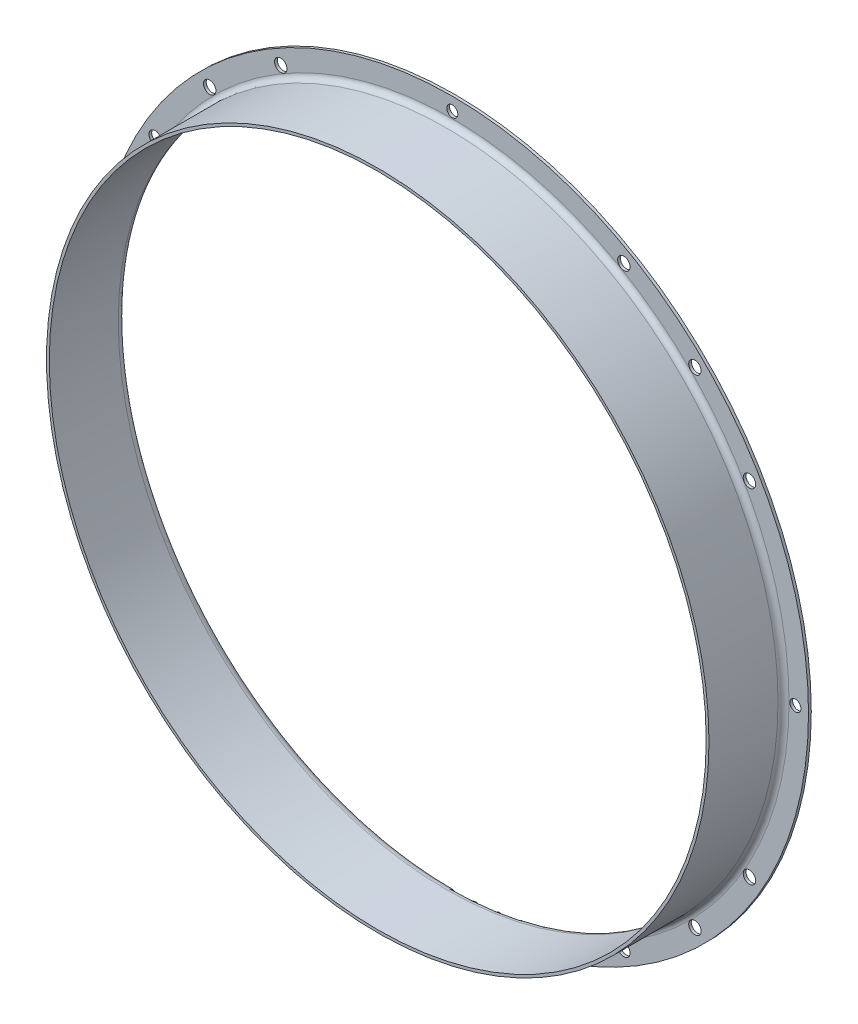
ISO-10303-21;
HEADER;
FILE_DESCRIPTION(('STEP AP214'),'2;1');
FILE_NAME('part.step','',(''),(''),'','','');
FILE_SCHEMA(('AUTOMOTIVE_DESIGN { 1 0 10303 214 1 1 1 1 }'));
ENDSEC;
DATA;
#1=APPLICATION_CONTEXT('core data for automotive mechanical design processes');
#2=APPLICATION_PROTOCOL_DEFINITION('international standard','automotive_design',2000,#1);
#3=PRODUCT_CONTEXT('',#1,'mechanical');
#4=PRODUCT('Part','Part','',(#3));
#5=PRODUCT_RELATED_PRODUCT_CATEGORY('part','',(#4));
#6=PRODUCT_DEFINITION_FORMATION('','',#4);
#7=PRODUCT_DEFINITION_CONTEXT('part definition',#1,'design');
#8=PRODUCT_DEFINITION('design','',#6,#7);
#9=PRODUCT_DEFINITION_SHAPE('','',#8);
#10=(LENGTH_UNIT() NAMED_UNIT(*) SI_UNIT(.MILLI.,.METRE.));
#11=(NAMED_UNIT(*) PLANE_ANGLE_UNIT() SI_UNIT($,.RADIAN.));
#12=(NAMED_UNIT(*) SI_UNIT($,.STERADIAN.) SOLID_ANGLE_UNIT());
#13=UNCERTAINTY_MEASURE_WITH_UNIT(LENGTH_MEASURE(1.E-05),#10,'distance_accuracy_value','');
#14=(GEOMETRIC_REPRESENTATION_CONTEXT(3) GLOBAL_UNCERTAINTY_ASSIGNED_CONTEXT((#13)) GLOBAL_UNIT_ASSIGNED_CONTEXT((#10,
#11,#12)) REPRESENTATION_CONTEXT('',''));
#15=CARTESIAN_POINT('',(0.,0.,0.));
#16=DIRECTION('',(0.,0.,1.));
#17=DIRECTION('',(1.,0.,0.));
#18=AXIS2_PLACEMENT_3D('',#15,#16,#17);
#19=CARTESIAN_POINT('',(0.,121.95,0.999999999999999));
#20=DIRECTION('',(0.,0.,-1.));
#21=DIRECTION('',(-1.,0.,0.));
#22=AXIS2_PLACEMENT_3D('',#19,#20,#21);
#23=PLANE('',#22);
#24=CARTESIAN_POINT('',(-87.8580175624281,-87.858017562429,0.999999999999999));
#25=DIRECTION('',(0.,0.,1.));
#26=DIRECTION('',(1.,0.,0.));
#27=AXIS2_PLACEMENT_3D('',#24,#25,#26);
#28=CIRCLE('',#27,2.25);
#29=CARTESIAN_POINT('',(-85.6080175624281,-87.858017562429,0.999999999999999));
#30=VERTEX_POINT('',#29);
#31=EDGE_CURVE('E50',#30,#30,#28,.T.);
#32=ORIENTED_EDGE('',*,*,#31,.F.);
#33=EDGE_LOOP('',(#32));
#34=FACE_BOUND('',#33,.T.);
#35=CARTESIAN_POINT('',(-87.8580175624293,87.8580175624277,0.999999999999999));
#36=DIRECTION('',(0.,0.,1.));
#37=DIRECTION('',(1.,0.,0.));
#38=AXIS2_PLACEMENT_3D('',#35,#36,#37);
#39=CIRCLE('',#38,2.25);
#40=CARTESIAN_POINT('',(-85.6080175624293,87.8580175624277,0.999999999999999));
#41=VERTEX_POINT('',#40);
#42=EDGE_CURVE('E49',#41,#41,#39,.T.);
#43=ORIENTED_EDGE('',*,*,#42,.F.);
#44=EDGE_LOOP('',(#43));
#45=FACE_BOUND('',#44,.T.);
#46=CARTESIAN_POINT('',(87.8580175624281,87.858017562429,0.999999999999999));
#47=DIRECTION('',(0.,0.,1.));
#48=DIRECTION('',(1.,0.,0.));
#49=AXIS2_PLACEMENT_3D('',#46,#47,#48);
#50=CIRCLE('',#49,2.25);
#51=CARTESIAN_POINT('',(90.1080175624281,87.858017562429,0.999999999999999));
#52=VERTEX_POINT('',#51);
#53=EDGE_CURVE('E66',#52,#52,#50,.T.);
#54=ORIENTED_EDGE('',*,*,#53,.F.);
#55=EDGE_LOOP('',(#54));
#56=FACE_BOUND('',#55,.T.);
#57=CARTESIAN_POINT('',(-124.25,0.,0.999999999999999));
#58=DIRECTION('',(0.,0.,1.));
#59=DIRECTION('',(1.,0.,0.));
#60=AXIS2_PLACEMENT_3D('',#57,#58,#59);
#61=CIRCLE('',#60,2.);
#62=CARTESIAN_POINT('',(-122.25,0.,0.999999999999999));
#63=VERTEX_POINT('',#62);
#64=EDGE_CURVE('E78',#63,#63,#61,.T.);
#65=ORIENTED_EDGE('',*,*,#64,.F.);
#66=EDGE_LOOP('',(#65));
#67=FACE_BOUND('',#66,.T.);
#68=CARTESIAN_POINT('',(-4.33816556351259E-13,124.25,0.999999999999999));
#69=DIRECTION('',(0.,0.,1.));
#70=DIRECTION('',(1.,0.,0.));
#71=AXIS2_PLACEMENT_3D('',#68,#69,#70);
#72=CIRCLE('',#71,2.);
#73=CARTESIAN_POINT('',(1.99999999999957,124.25,0.999999999999999));
#74=VERTEX_POINT('',#73);
#75=EDGE_CURVE('E84',#74,#74,#72,.T.);
#76=ORIENTED_EDGE('',*,*,#75,.F.);
#77=EDGE_LOOP('',(#76));
#78=FACE_BOUND('',#77,.T.);
#79=CARTESIAN_POINT('',(124.25,0.,0.999999999999999));
#80=DIRECTION('',(0.,0.,1.));
#81=DIRECTION('',(1.,0.,0.));
#82=AXIS2_PLACEMENT_3D('',#79,#80,#81);
#83=CIRCLE('',#82,2.);
#84=CARTESIAN_POINT('',(126.25,0.,0.999999999999999));
#85=VERTEX_POINT('',#84);
#86=EDGE_CURVE('E90',#85,#85,#83,.T.);
#87=ORIENTED_EDGE('',*,*,#86,.F.);
#88=EDGE_LOOP('',(#87));
#89=FACE_BOUND('',#88,.T.);
#90=CARTESIAN_POINT('',(107.603656420216,62.1250000000013,1.));
#91=DIRECTION('',(0.,0.,1.));
#92=DIRECTION('',(1.,0.,0.));
#93=AXIS2_PLACEMENT_3D('',#90,#91,#92);
#94=CIRCLE('',#93,2.24999999999999);
#95=CARTESIAN_POINT('',(109.853656420216,62.1250000000013,1.));
#96=VERTEX_POINT('',#95);
#97=EDGE_CURVE('E96',#96,#96,#94,.T.);
#98=ORIENTED_EDGE('',*,*,#97,.F.);
#99=EDGE_LOOP('',(#98));
#100=FACE_BOUND('',#99,.T.);
#101=CARTESIAN_POINT('',(107.603656420217,-62.124999999999,1.));
#102=DIRECTION('',(0.,0.,1.));
#103=DIRECTION('',(1.,0.,0.));
#104=AXIS2_PLACEMENT_3D('',#101,#102,#103);
#105=CIRCLE('',#104,2.24999999999999);
#106=CARTESIAN_POINT('',(109.853656420217,-62.124999999999,1.));
#107=VERTEX_POINT('',#106);
#108=EDGE_CURVE('E102',#107,#107,#105,.T.);
#109=ORIENTED_EDGE('',*,*,#108,.F.);
#110=EDGE_LOOP('',(#109));
#111=FACE_BOUND('',#110,.T.);
#112=CARTESIAN_POINT('',(62.1250000000009,-107.603656420216,1.));
#113=DIRECTION('',(0.,0.,1.));
#114=DIRECTION('',(1.,0.,0.));
#115=AXIS2_PLACEMENT_3D('',#112,#113,#114);
#116=CIRCLE('',#115,2.24999999999999);
#117=CARTESIAN_POINT('',(64.3750000000009,-107.603656420216,1.));
#118=VERTEX_POINT('',#117);
#119=EDGE_CURVE('E108',#118,#118,#116,.T.);
#120=ORIENTED_EDGE('',*,*,#119,.F.);
#121=EDGE_LOOP('',(#120));
#122=FACE_BOUND('',#121,.T.);
#123=CARTESIAN_POINT('',(-62.1250000000001,-107.603656420216,1.));
#124=DIRECTION('',(0.,0.,1.));
#125=DIRECTION('',(1.,0.,0.));
#126=AXIS2_PLACEMENT_3D('',#123,#124,#125);
#127=CIRCLE('',#126,2.24999999999999);
#128=CARTESIAN_POINT('',(-59.8750000000001,-107.603656420216,1.));
#129=VERTEX_POINT('',#128);
#130=EDGE_CURVE('E114',#129,#129,#127,.T.);
#131=ORIENTED_EDGE('',*,*,#130,.F.);
#132=EDGE_LOOP('',(#131));
#133=FACE_BOUND('',#132,.T.);
#134=CARTESIAN_POINT('',(-107.603656420216,-62.1250000000005,1.));
#135=DIRECTION('',(0.,0.,1.));
#136=DIRECTION('',(1.,0.,0.));
#137=AXIS2_PLACEMENT_3D('',#134,#135,#136);
#138=CIRCLE('',#137,2.24999999999999);
#139=CARTESIAN_POINT('',(-105.353656420216,-62.1250000000005,1.));
#140=VERTEX_POINT('',#139);
#141=EDGE_CURVE('E120',#140,#140,#138,.T.);
#142=ORIENTED_EDGE('',*,*,#141,.F.);
#143=EDGE_LOOP('',(#142));
#144=FACE_BOUND('',#143,.T.);
#145=CARTESIAN_POINT('',(-107.603656420217,62.1249999999997,1.));
#146=DIRECTION('',(0.,0.,1.));
#147=DIRECTION('',(1.,0.,0.));
#148=AXIS2_PLACEMENT_3D('',#145,#146,#147);
#149=CIRCLE('',#148,2.24999999999999);
#150=CARTESIAN_POINT('',(-105.353656420217,62.1249999999997,1.));
#151=VERTEX_POINT('',#150);
#152=EDGE_CURVE('E126',#151,#151,#149,.T.);
#153=ORIENTED_EDGE('',*,*,#152,.F.);
#154=EDGE_LOOP('',(#153));
#155=FACE_BOUND('',#154,.T.);
#156=CARTESIAN_POINT('',(-62.1250000000001,107.603656420216,1.));
#157=DIRECTION('',(0.,0.,1.));
#158=DIRECTION('',(1.,0.,0.));
#159=AXIS2_PLACEMENT_3D('',#156,#157,#158);
#160=CIRCLE('',#159,2.24999999999999);
#161=CARTESIAN_POINT('',(-59.8750000000002,107.603656420216,1.));
#162=VERTEX_POINT('',#161);
#163=EDGE_CURVE('E132',#162,#162,#160,.T.);
#164=ORIENTED_EDGE('',*,*,#163,.F.);
#165=EDGE_LOOP('',(#164));
#166=FACE_BOUND('',#165,.T.);
#167=CARTESIAN_POINT('',(62.1250000000001,107.603656420216,1.));
#168=DIRECTION('',(0.,0.,1.));
#169=DIRECTION('',(1.,0.,0.));
#170=AXIS2_PLACEMENT_3D('',#167,#168,#169);
#171=CIRCLE('',#170,2.24999999999999);
#172=CARTESIAN_POINT('',(64.3750000000001,107.603656420216,1.));
#173=VERTEX_POINT('',#172);
#174=EDGE_CURVE('E138',#173,#173,#171,.T.);
#175=ORIENTED_EDGE('',*,*,#174,.F.);
#176=EDGE_LOOP('',(#175));
#177=FACE_BOUND('',#176,.T.);
#178=CARTESIAN_POINT('',(0.,0.,1.));
#179=DIRECTION('',(0.,0.,1.));
#180=DIRECTION('',(1.,0.,0.));
#181=AXIS2_PLACEMENT_3D('',#178,#179,#180);
#182=CIRCLE('',#181,121.95);
#183=CARTESIAN_POINT('',(121.95,0.,1.));
#184=VERTEX_POINT('',#183);
#185=EDGE_CURVE('E147',#184,#184,#182,.T.);
#186=ORIENTED_EDGE('',*,*,#185,.F.);
#187=EDGE_LOOP('',(#186));
#188=FACE_BOUND('',#187,.T.);
#189=CARTESIAN_POINT('',(0.,0.,1.));
#190=DIRECTION('',(0.,0.,1.));
#191=DIRECTION('',(1.,0.,0.));
#192=AXIS2_PLACEMENT_3D('',#189,#190,#191);
#193=CIRCLE('',#192,129.);
#194=CARTESIAN_POINT('',(129.,0.,1.));
#195=VERTEX_POINT('',#194);
#196=EDGE_CURVE('E144',#195,#195,#193,.T.);
#197=ORIENTED_EDGE('',*,*,#196,.T.);
#198=EDGE_LOOP('',(#197));
#199=FACE_BOUND('',#198,.T.);
#200=CARTESIAN_POINT('',(1.30144966905378E-12,-124.25,0.999999999999999));
#201=DIRECTION('',(0.,0.,1.));
#202=DIRECTION('',(1.,0.,0.));
#203=AXIS2_PLACEMENT_3D('',#200,#201,#202);
#204=CIRCLE('',#203,2.);
#205=CARTESIAN_POINT('',(2.0000000000013,-124.25,0.999999999999999));
#206=VERTEX_POINT('',#205);
#207=EDGE_CURVE('E72',#206,#206,#204,.T.);
#208=ORIENTED_EDGE('',*,*,#207,.F.);
#209=EDGE_LOOP('',(#208));
#210=FACE_BOUND('',#209,.T.);
#211=CARTESIAN_POINT('',(87.8580175624299,-87.8580175624271,0.999999999999999));
#212=DIRECTION('',(0.,0.,1.));
#213=DIRECTION('',(1.,0.,0.));
#214=AXIS2_PLACEMENT_3D('',#211,#212,#213);
#215=CIRCLE('',#214,2.25);
#216=CARTESIAN_POINT('',(90.1080175624299,-87.8580175624271,0.999999999999999));
#217=VERTEX_POINT('',#216);
#218=EDGE_CURVE('E61',#217,#217,#215,.T.);
#219=ORIENTED_EDGE('',*,*,#218,.F.);
#220=EDGE_LOOP('',(#219));
#221=FACE_BOUND('',#220,.T.);
#222=ADVANCED_FACE('F31',(#34,#45,#56,#67,#78,#89,#100,#111,#122,#133,#144,#155,#166,#177,#188,
#199,#210,#221),#23,.F.);
#223=CARTESIAN_POINT('',(0.,0.,36.2891250479502));
#224=DIRECTION('',(0.,0.,1.));
#225=DIRECTION('',(1.,0.,0.));
#226=AXIS2_PLACEMENT_3D('',#223,#224,#225);
#227=CYLINDRICAL_SURFACE('',#226,129.);
#228=ORIENTED_EDGE('',*,*,#196,.F.);
#229=EDGE_LOOP('',(#228));
#230=FACE_BOUND('',#229,.T.);
#231=CARTESIAN_POINT('',(0.,0.,0.));
#232=DIRECTION('',(0.,0.,1.));
#233=DIRECTION('',(1.,0.,0.));
#234=AXIS2_PLACEMENT_3D('',#231,#232,#233);
#235=CIRCLE('',#234,129.);
#236=CARTESIAN_POINT('',(129.,0.,0.));
#237=VERTEX_POINT('',#236);
#238=EDGE_CURVE('E10',#237,#237,#235,.T.);
#239=ORIENTED_EDGE('',*,*,#238,.T.);
#240=EDGE_LOOP('',(#239));
#241=FACE_BOUND('',#240,.T.);
#242=ADVANCED_FACE('F33',(#230,#241),#227,.T.);
#243=CARTESIAN_POINT('',(0.,129.,0.));
#244=DIRECTION('',(0.,0.,1.));
#245=DIRECTION('',(1.,0.,0.));
#246=AXIS2_PLACEMENT_3D('',#243,#244,#245);
#247=PLANE('',#246);
#248=CARTESIAN_POINT('',(87.8580175624299,-87.8580175624271,0.));
#249=DIRECTION('',(0.,0.,1.));
#250=DIRECTION('',(1.,0.,0.));
#251=AXIS2_PLACEMENT_3D('',#248,#249,#250);
#252=CIRCLE('',#251,2.25);
#253=CARTESIAN_POINT('',(90.1080175624299,-87.8580175624271,0.));
#254=VERTEX_POINT('',#253);
#255=EDGE_CURVE('E35',#254,#254,#252,.T.);
#256=ORIENTED_EDGE('',*,*,#255,.T.);
#257=EDGE_LOOP('',(#256));
#258=FACE_BOUND('',#257,.T.);
#259=CARTESIAN_POINT('',(-87.8580175624281,-87.858017562429,0.));
#260=DIRECTION('',(0.,0.,1.));
#261=DIRECTION('',(1.,0.,0.));
#262=AXIS2_PLACEMENT_3D('',#259,#260,#261);
#263=CIRCLE('',#262,2.25);
#264=CARTESIAN_POINT('',(-85.6080175624281,-87.858017562429,0.));
#265=VERTEX_POINT('',#264);
#266=EDGE_CURVE('E47',#265,#265,#263,.T.);
#267=ORIENTED_EDGE('',*,*,#266,.T.);
#268=EDGE_LOOP('',(#267));
#269=FACE_BOUND('',#268,.T.);
#270=CARTESIAN_POINT('',(-87.8580175624293,87.8580175624277,0.));
#271=DIRECTION('',(0.,0.,1.));
#272=DIRECTION('',(1.,0.,0.));
#273=AXIS2_PLACEMENT_3D('',#270,#271,#272);
#274=CIRCLE('',#273,2.25);
#275=CARTESIAN_POINT('',(-85.6080175624293,87.8580175624277,0.));
#276=VERTEX_POINT('',#275);
#277=EDGE_CURVE('E54',#276,#276,#274,.T.);
#278=ORIENTED_EDGE('',*,*,#277,.T.);
#279=EDGE_LOOP('',(#278));
#280=FACE_BOUND('',#279,.T.);
#281=CARTESIAN_POINT('',(87.8580175624281,87.858017562429,0.));
#282=DIRECTION('',(0.,0.,1.));
#283=DIRECTION('',(1.,0.,0.));
#284=AXIS2_PLACEMENT_3D('',#281,#282,#283);
#285=CIRCLE('',#284,2.25);
#286=CARTESIAN_POINT('',(90.1080175624281,87.858017562429,0.));
#287=VERTEX_POINT('',#286);
#288=EDGE_CURVE('E69',#287,#287,#285,.T.);
#289=ORIENTED_EDGE('',*,*,#288,.T.);
#290=EDGE_LOOP('',(#289));
#291=FACE_BOUND('',#290,.T.);
#292=CARTESIAN_POINT('',(1.30144966905378E-12,-124.25,0.));
#293=DIRECTION('',(0.,0.,1.));
#294=DIRECTION('',(1.,0.,0.));
#295=AXIS2_PLACEMENT_3D('',#292,#293,#294);
#296=CIRCLE('',#295,2.);
#297=CARTESIAN_POINT('',(2.0000000000013,-124.25,0.));
#298=VERTEX_POINT('',#297);
#299=EDGE_CURVE('E75',#298,#298,#296,.T.);
#300=ORIENTED_EDGE('',*,*,#299,.T.);
#301=EDGE_LOOP('',(#300));
#302=FACE_BOUND('',#301,.T.);
#303=CARTESIAN_POINT('',(-124.25,0.,0.));
#304=DIRECTION('',(0.,0.,1.));
#305=DIRECTION('',(1.,0.,0.));
#306=AXIS2_PLACEMENT_3D('',#303,#304,#305);
#307=CIRCLE('',#306,2.);
#308=CARTESIAN_POINT('',(-122.25,0.,0.));
#309=VERTEX_POINT('',#308);
#310=EDGE_CURVE('E81',#309,#309,#307,.T.);
#311=ORIENTED_EDGE('',*,*,#310,.T.);
#312=EDGE_LOOP('',(#311));
#313=FACE_BOUND('',#312,.T.);
#314=CARTESIAN_POINT('',(-4.33816556351259E-13,124.25,0.));
#315=DIRECTION('',(0.,0.,1.));
#316=DIRECTION('',(1.,0.,0.));
#317=AXIS2_PLACEMENT_3D('',#314,#315,#316);
#318=CIRCLE('',#317,2.);
#319=CARTESIAN_POINT('',(1.99999999999957,124.25,0.));
#320=VERTEX_POINT('',#319);
#321=EDGE_CURVE('E87',#320,#320,#318,.T.);
#322=ORIENTED_EDGE('',*,*,#321,.T.);
#323=EDGE_LOOP('',(#322));
#324=FACE_BOUND('',#323,.T.);
#325=CARTESIAN_POINT('',(124.25,0.,0.));
#326=DIRECTION('',(0.,0.,1.));
#327=DIRECTION('',(1.,0.,0.));
#328=AXIS2_PLACEMENT_3D('',#325,#326,#327);
#329=CIRCLE('',#328,2.);
#330=CARTESIAN_POINT('',(126.25,0.,0.));
#331=VERTEX_POINT('',#330);
#332=EDGE_CURVE('E93',#331,#331,#329,.T.);
#333=ORIENTED_EDGE('',*,*,#332,.T.);
#334=EDGE_LOOP('',(#333));
#335=FACE_BOUND('',#334,.T.);
#336=CARTESIAN_POINT('',(107.603656420216,62.1250000000013,0.));
#337=DIRECTION('',(0.,0.,1.));
#338=DIRECTION('',(1.,0.,0.));
#339=AXIS2_PLACEMENT_3D('',#336,#337,#338);
#340=CIRCLE('',#339,2.25);
#341=CARTESIAN_POINT('',(109.853656420216,62.1250000000013,0.));
#342=VERTEX_POINT('',#341);
#343=EDGE_CURVE('E99',#342,#342,#340,.T.);
#344=ORIENTED_EDGE('',*,*,#343,.T.);
#345=EDGE_LOOP('',(#344));
#346=FACE_BOUND('',#345,.T.);
#347=CARTESIAN_POINT('',(107.603656420217,-62.124999999999,0.));
#348=DIRECTION('',(0.,0.,1.));
#349=DIRECTION('',(1.,0.,0.));
#350=AXIS2_PLACEMENT_3D('',#347,#348,#349);
#351=CIRCLE('',#350,2.25);
#352=CARTESIAN_POINT('',(109.853656420217,-62.124999999999,0.));
#353=VERTEX_POINT('',#352);
#354=EDGE_CURVE('E105',#353,#353,#351,.T.);
#355=ORIENTED_EDGE('',*,*,#354,.T.);
#356=EDGE_LOOP('',(#355));
#357=FACE_BOUND('',#356,.T.);
#358=CARTESIAN_POINT('',(62.1250000000009,-107.603656420216,0.));
#359=DIRECTION('',(0.,0.,1.));
#360=DIRECTION('',(1.,0.,0.));
#361=AXIS2_PLACEMENT_3D('',#358,#359,#360);
#362=CIRCLE('',#361,2.25);
#363=CARTESIAN_POINT('',(64.3750000000009,-107.603656420216,0.));
#364=VERTEX_POINT('',#363);
#365=EDGE_CURVE('E111',#364,#364,#362,.T.);
#366=ORIENTED_EDGE('',*,*,#365,.T.);
#367=EDGE_LOOP('',(#366));
#368=FACE_BOUND('',#367,.T.);
#369=CARTESIAN_POINT('',(-62.1250000000001,-107.603656420216,0.));
#370=DIRECTION('',(0.,0.,1.));
#371=DIRECTION('',(1.,0.,0.));
#372=AXIS2_PLACEMENT_3D('',#369,#370,#371);
#373=CIRCLE('',#372,2.25);
#374=CARTESIAN_POINT('',(-59.8750000000001,-107.603656420216,0.));
#375=VERTEX_POINT('',#374);
#376=EDGE_CURVE('E117',#375,#375,#373,.T.);
#377=ORIENTED_EDGE('',*,*,#376,.T.);
#378=EDGE_LOOP('',(#377));
#379=FACE_BOUND('',#378,.T.);
#380=CARTESIAN_POINT('',(-107.603656420216,-62.1250000000005,0.));
#381=DIRECTION('',(0.,0.,1.));
#382=DIRECTION('',(1.,0.,0.));
#383=AXIS2_PLACEMENT_3D('',#380,#381,#382);
#384=CIRCLE('',#383,2.25);
#385=CARTESIAN_POINT('',(-105.353656420216,-62.1250000000005,0.));
#386=VERTEX_POINT('',#385);
#387=EDGE_CURVE('E123',#386,#386,#384,.T.);
#388=ORIENTED_EDGE('',*,*,#387,.T.);
#389=EDGE_LOOP('',(#388));
#390=FACE_BOUND('',#389,.T.);
#391=CARTESIAN_POINT('',(-107.603656420217,62.1249999999997,0.));
#392=DIRECTION('',(0.,0.,1.));
#393=DIRECTION('',(1.,0.,0.));
#394=AXIS2_PLACEMENT_3D('',#391,#392,#393);
#395=CIRCLE('',#394,2.25);
#396=CARTESIAN_POINT('',(-105.353656420217,62.1249999999997,0.));
#397=VERTEX_POINT('',#396);
#398=EDGE_CURVE('E129',#397,#397,#395,.T.);
#399=ORIENTED_EDGE('',*,*,#398,.T.);
#400=EDGE_LOOP('',(#399));
#401=FACE_BOUND('',#400,.T.);
#402=CARTESIAN_POINT('',(-62.1250000000001,107.603656420216,0.));
#403=DIRECTION('',(0.,0.,1.));
#404=DIRECTION('',(1.,0.,0.));
#405=AXIS2_PLACEMENT_3D('',#402,#403,#404);
#406=CIRCLE('',#405,2.25);
#407=CARTESIAN_POINT('',(-59.8750000000001,107.603656420216,0.));
#408=VERTEX_POINT('',#407);
#409=EDGE_CURVE('E135',#408,#408,#406,.T.);
#410=ORIENTED_EDGE('',*,*,#409,.T.);
#411=EDGE_LOOP('',(#410));
#412=FACE_BOUND('',#411,.T.);
#413=CARTESIAN_POINT('',(62.1250000000001,107.603656420216,0.));
#414=DIRECTION('',(0.,0.,1.));
#415=DIRECTION('',(1.,0.,0.));
#416=AXIS2_PLACEMENT_3D('',#413,#414,#415);
#417=CIRCLE('',#416,2.25);
#418=CARTESIAN_POINT('',(64.3750000000001,107.603656420216,0.));
#419=VERTEX_POINT('',#418);
#420=EDGE_CURVE('E141',#419,#419,#417,.T.);
#421=ORIENTED_EDGE('',*,*,#420,.T.);
#422=EDGE_LOOP('',(#421));
#423=FACE_BOUND('',#422,.T.);
#424=ORIENTED_EDGE('',*,*,#238,.F.);
#425=EDGE_LOOP('',(#424));
#426=FACE_BOUND('',#425,.T.);
#427=CARTESIAN_POINT('',(0.,0.,0.));
#428=DIRECTION('',(0.,0.,1.));
#429=DIRECTION('',(1.,0.,0.));
#430=AXIS2_PLACEMENT_3D('',#427,#428,#429);
#431=CIRCLE('',#430,121.95);
#432=CARTESIAN_POINT('',(121.95,0.,0.));
#433=VERTEX_POINT('',#432);
#434=EDGE_CURVE('E39',#433,#433,#431,.T.);
#435=ORIENTED_EDGE('',*,*,#434,.T.);
#436=EDGE_LOOP('',(#435));
#437=FACE_BOUND('',#436,.T.);
#438=ADVANCED_FACE('F206',(#258,#269,#280,#291,#302,#313,#324,#335,#346,#357,#368,#379,#390,
#401,#412,#423,#426,#437),#247,.F.);
#439=CARTESIAN_POINT('',(0.,0.,3.));
#440=DIRECTION('',(0.,0.,1.));
#441=DIRECTION('',(1.,0.,0.));
#442=AXIS2_PLACEMENT_3D('',#439,#440,#441);
#443=TOROIDAL_SURFACE('',#442,121.95,3.);
#444=ORIENTED_EDGE('',*,*,#434,.F.);
#445=EDGE_LOOP('',(#444));
#446=FACE_BOUND('',#445,.T.);
#447=CARTESIAN_POINT('',(0.,0.,3.));
#448=DIRECTION('',(0.,0.,1.));
#449=DIRECTION('',(1.,0.,0.));
#450=AXIS2_PLACEMENT_3D('',#447,#448,#449);
#451=CIRCLE('',#450,118.95);
#452=CARTESIAN_POINT('',(118.95,0.,3.));
#453=VERTEX_POINT('',#452);
#454=EDGE_CURVE('E44',#453,#453,#451,.T.);
#455=ORIENTED_EDGE('',*,*,#454,.T.);
#456=EDGE_LOOP('',(#455));
#457=FACE_BOUND('',#456,.T.);
#458=ADVANCED_FACE('F161',(#446,#457),#443,.T.);
#459=CARTESIAN_POINT('',(0.,0.,36.2891250479502));
#460=DIRECTION('',(0.,0.,1.));
#461=DIRECTION('',(1.,0.,0.));
#462=AXIS2_PLACEMENT_3D('',#459,#460,#461);
#463=CYLINDRICAL_SURFACE('',#462,118.95);
#464=ORIENTED_EDGE('',*,*,#454,.F.);
#465=EDGE_LOOP('',(#464));
#466=FACE_BOUND('',#465,.T.);
#467=CARTESIAN_POINT('',(0.,0.,28.));
#468=DIRECTION('',(0.,0.,1.));
#469=DIRECTION('',(1.,0.,0.));
#470=AXIS2_PLACEMENT_3D('',#467,#468,#469);
#471=CIRCLE('',#470,118.95);
#472=CARTESIAN_POINT('',(118.95,0.,28.));
#473=VERTEX_POINT('',#472);
#474=EDGE_CURVE('E156',#473,#473,#471,.T.);
#475=ORIENTED_EDGE('',*,*,#474,.T.);
#476=EDGE_LOOP('',(#475));
#477=FACE_BOUND('',#476,.T.);
#478=ADVANCED_FACE('F163',(#466,#477),#463,.F.);
#479=CARTESIAN_POINT('',(0.,118.95,28.));
#480=DIRECTION('',(0.,0.,-1.));
#481=DIRECTION('',(-1.,0.,0.));
#482=AXIS2_PLACEMENT_3D('',#479,#480,#481);
#483=PLANE('',#482);
#484=ORIENTED_EDGE('',*,*,#474,.F.);
#485=EDGE_LOOP('',(#484));
#486=FACE_BOUND('',#485,.T.);
#487=CARTESIAN_POINT('',(0.,0.,28.));
#488=DIRECTION('',(0.,0.,1.));
#489=DIRECTION('',(1.,0.,0.));
#490=AXIS2_PLACEMENT_3D('',#487,#488,#489);
#491=CIRCLE('',#490,119.95);
#492=CARTESIAN_POINT('',(119.95,0.,28.));
#493=VERTEX_POINT('',#492);
#494=EDGE_CURVE('E153',#493,#493,#491,.T.);
#495=ORIENTED_EDGE('',*,*,#494,.T.);
#496=EDGE_LOOP('',(#495));
#497=FACE_BOUND('',#496,.T.);
#498=ADVANCED_FACE('F166',(#486,#497),#483,.F.);
#499=CARTESIAN_POINT('',(0.,0.,36.2891250479502));
#500=DIRECTION('',(0.,0.,1.));
#501=DIRECTION('',(1.,0.,0.));
#502=AXIS2_PLACEMENT_3D('',#499,#500,#501);
#503=CYLINDRICAL_SURFACE('',#502,119.95);
#504=ORIENTED_EDGE('',*,*,#494,.F.);
#505=EDGE_LOOP('',(#504));
#506=FACE_BOUND('',#505,.T.);
#507=CARTESIAN_POINT('',(0.,0.,3.));
#508=DIRECTION('',(0.,0.,1.));
#509=DIRECTION('',(1.,0.,0.));
#510=AXIS2_PLACEMENT_3D('',#507,#508,#509);
#511=CIRCLE('',#510,119.95);
#512=CARTESIAN_POINT('',(119.95,0.,3.));
#513=VERTEX_POINT('',#512);
#514=EDGE_CURVE('E150',#513,#513,#511,.T.);
#515=ORIENTED_EDGE('',*,*,#514,.T.);
#516=EDGE_LOOP('',(#515));
#517=FACE_BOUND('',#516,.T.);
#518=ADVANCED_FACE('F172',(#506,#517),#503,.T.);
#519=CARTESIAN_POINT('',(0.,0.,3.));
#520=DIRECTION('',(0.,0.,1.));
#521=DIRECTION('',(1.,0.,0.));
#522=AXIS2_PLACEMENT_3D('',#519,#520,#521);
#523=TOROIDAL_SURFACE('',#522,121.95,2.);
#524=ORIENTED_EDGE('',*,*,#514,.F.);
#525=EDGE_LOOP('',(#524));
#526=FACE_BOUND('',#525,.T.);
#527=ORIENTED_EDGE('',*,*,#185,.T.);
#528=EDGE_LOOP('',(#527));
#529=FACE_BOUND('',#528,.T.);
#530=ADVANCED_FACE('F178',(#526,#529),#523,.F.);
#531=CARTESIAN_POINT('',(62.1250000000001,107.603656420216,0.999999999999999));
#532=DIRECTION('',(0.,0.,1.));
#533=DIRECTION('',(1.,0.,0.));
#534=AXIS2_PLACEMENT_3D('',#531,#532,#533);
#535=CYLINDRICAL_SURFACE('',#534,2.25);
#536=ORIENTED_EDGE('',*,*,#420,.F.);
#537=EDGE_LOOP('',(#536));
#538=FACE_BOUND('',#537,.T.);
#539=ORIENTED_EDGE('',*,*,#174,.T.);
#540=EDGE_LOOP('',(#539));
#541=FACE_BOUND('',#540,.T.);
#542=ADVANCED_FACE('F184',(#538,#541),#535,.F.);
#543=CARTESIAN_POINT('',(-62.1250000000001,107.603656420216,0.999999999999999));
#544=DIRECTION('',(0.,0.,1.));
#545=DIRECTION('',(1.,0.,0.));
#546=AXIS2_PLACEMENT_3D('',#543,#544,#545);
#547=CYLINDRICAL_SURFACE('',#546,2.25);
#548=ORIENTED_EDGE('',*,*,#409,.F.);
#549=EDGE_LOOP('',(#548));
#550=FACE_BOUND('',#549,.T.);
#551=ORIENTED_EDGE('',*,*,#163,.T.);
#552=EDGE_LOOP('',(#551));
#553=FACE_BOUND('',#552,.T.);
#554=ADVANCED_FACE('F247',(#550,#553),#547,.F.);
#555=CARTESIAN_POINT('',(-107.603656420217,62.1249999999997,0.999999999999999));
#556=DIRECTION('',(0.,0.,1.));
#557=DIRECTION('',(1.,0.,0.));
#558=AXIS2_PLACEMENT_3D('',#555,#556,#557);
#559=CYLINDRICAL_SURFACE('',#558,2.25);
#560=ORIENTED_EDGE('',*,*,#398,.F.);
#561=EDGE_LOOP('',(#560));
#562=FACE_BOUND('',#561,.T.);
#563=ORIENTED_EDGE('',*,*,#152,.T.);
#564=EDGE_LOOP('',(#563));
#565=FACE_BOUND('',#564,.T.);
#566=ADVANCED_FACE('F251',(#562,#565),#559,.F.);
#567=CARTESIAN_POINT('',(-107.603656420216,-62.1250000000005,0.999999999999999));
#568=DIRECTION('',(0.,0.,1.));
#569=DIRECTION('',(1.,0.,0.));
#570=AXIS2_PLACEMENT_3D('',#567,#568,#569);
#571=CYLINDRICAL_SURFACE('',#570,2.25);
#572=ORIENTED_EDGE('',*,*,#387,.F.);
#573=EDGE_LOOP('',(#572));
#574=FACE_BOUND('',#573,.T.);
#575=ORIENTED_EDGE('',*,*,#141,.T.);
#576=EDGE_LOOP('',(#575));
#577=FACE_BOUND('',#576,.T.);
#578=ADVANCED_FACE('F255',(#574,#577),#571,.F.);
#579=CARTESIAN_POINT('',(-62.1250000000001,-107.603656420216,0.999999999999999));
#580=DIRECTION('',(0.,0.,1.));
#581=DIRECTION('',(1.,0.,0.));
#582=AXIS2_PLACEMENT_3D('',#579,#580,#581);
#583=CYLINDRICAL_SURFACE('',#582,2.25);
#584=ORIENTED_EDGE('',*,*,#376,.F.);
#585=EDGE_LOOP('',(#584));
#586=FACE_BOUND('',#585,.T.);
#587=ORIENTED_EDGE('',*,*,#130,.T.);
#588=EDGE_LOOP('',(#587));
#589=FACE_BOUND('',#588,.T.);
#590=ADVANCED_FACE('F259',(#586,#589),#583,.F.);
#591=CARTESIAN_POINT('',(62.1250000000009,-107.603656420216,0.999999999999999));
#592=DIRECTION('',(0.,0.,1.));
#593=DIRECTION('',(1.,0.,0.));
#594=AXIS2_PLACEMENT_3D('',#591,#592,#593);
#595=CYLINDRICAL_SURFACE('',#594,2.25);
#596=ORIENTED_EDGE('',*,*,#365,.F.);
#597=EDGE_LOOP('',(#596));
#598=FACE_BOUND('',#597,.T.);
#599=ORIENTED_EDGE('',*,*,#119,.T.);
#600=EDGE_LOOP('',(#599));
#601=FACE_BOUND('',#600,.T.);
#602=ADVANCED_FACE('F263',(#598,#601),#595,.F.);
#603=CARTESIAN_POINT('',(107.603656420217,-62.124999999999,0.999999999999999));
#604=DIRECTION('',(0.,0.,1.));
#605=DIRECTION('',(1.,0.,0.));
#606=AXIS2_PLACEMENT_3D('',#603,#604,#605);
#607=CYLINDRICAL_SURFACE('',#606,2.25);
#608=ORIENTED_EDGE('',*,*,#354,.F.);
#609=EDGE_LOOP('',(#608));
#610=FACE_BOUND('',#609,.T.);
#611=ORIENTED_EDGE('',*,*,#108,.T.);
#612=EDGE_LOOP('',(#611));
#613=FACE_BOUND('',#612,.T.);
#614=ADVANCED_FACE('F267',(#610,#613),#607,.F.);
#615=CARTESIAN_POINT('',(107.603656420216,62.1250000000013,0.999999999999999));
#616=DIRECTION('',(0.,0.,1.));
#617=DIRECTION('',(1.,0.,0.));
#618=AXIS2_PLACEMENT_3D('',#615,#616,#617);
#619=CYLINDRICAL_SURFACE('',#618,2.25);
#620=ORIENTED_EDGE('',*,*,#343,.F.);
#621=EDGE_LOOP('',(#620));
#622=FACE_BOUND('',#621,.T.);
#623=ORIENTED_EDGE('',*,*,#97,.T.);
#624=EDGE_LOOP('',(#623));
#625=FACE_BOUND('',#624,.T.);
#626=ADVANCED_FACE('F271',(#622,#625),#619,.F.);
#627=CARTESIAN_POINT('',(124.25,0.,0.999999999999999));
#628=DIRECTION('',(0.,0.,1.));
#629=DIRECTION('',(1.,0.,0.));
#630=AXIS2_PLACEMENT_3D('',#627,#628,#629);
#631=CYLINDRICAL_SURFACE('',#630,2.);
#632=ORIENTED_EDGE('',*,*,#332,.F.);
#633=EDGE_LOOP('',(#632));
#634=FACE_BOUND('',#633,.T.);
#635=ORIENTED_EDGE('',*,*,#86,.T.);
#636=EDGE_LOOP('',(#635));
#637=FACE_BOUND('',#636,.T.);
#638=ADVANCED_FACE('F275',(#634,#637),#631,.F.);
#639=CARTESIAN_POINT('',(-4.33816556351259E-13,124.25,0.999999999999999));
#640=DIRECTION('',(0.,0.,1.));
#641=DIRECTION('',(1.,0.,0.));
#642=AXIS2_PLACEMENT_3D('',#639,#640,#641);
#643=CYLINDRICAL_SURFACE('',#642,2.);
#644=ORIENTED_EDGE('',*,*,#321,.F.);
#645=EDGE_LOOP('',(#644));
#646=FACE_BOUND('',#645,.T.);
#647=ORIENTED_EDGE('',*,*,#75,.T.);
#648=EDGE_LOOP('',(#647));
#649=FACE_BOUND('',#648,.T.);
#650=ADVANCED_FACE('F279',(#646,#649),#643,.F.);
#651=CARTESIAN_POINT('',(-124.25,0.,0.999999999999999));
#652=DIRECTION('',(0.,0.,1.));
#653=DIRECTION('',(1.,0.,0.));
#654=AXIS2_PLACEMENT_3D('',#651,#652,#653);
#655=CYLINDRICAL_SURFACE('',#654,2.);
#656=ORIENTED_EDGE('',*,*,#310,.F.);
#657=EDGE_LOOP('',(#656));
#658=FACE_BOUND('',#657,.T.);
#659=ORIENTED_EDGE('',*,*,#64,.T.);
#660=EDGE_LOOP('',(#659));
#661=FACE_BOUND('',#660,.T.);
#662=ADVANCED_FACE('F283',(#658,#661),#655,.F.);
#663=CARTESIAN_POINT('',(1.30144966905378E-12,-124.25,0.999999999999999));
#664=DIRECTION('',(0.,0.,1.));
#665=DIRECTION('',(1.,0.,0.));
#666=AXIS2_PLACEMENT_3D('',#663,#664,#665);
#667=CYLINDRICAL_SURFACE('',#666,2.);
#668=ORIENTED_EDGE('',*,*,#299,.F.);
#669=EDGE_LOOP('',(#668));
#670=FACE_BOUND('',#669,.T.);
#671=ORIENTED_EDGE('',*,*,#207,.T.);
#672=EDGE_LOOP('',(#671));
#673=FACE_BOUND('',#672,.T.);
#674=ADVANCED_FACE('F287',(#670,#673),#667,.F.);
#675=CARTESIAN_POINT('',(87.8580175624281,87.858017562429,0.999999999999999));
#676=DIRECTION('',(0.,0.,1.));
#677=DIRECTION('',(1.,0.,0.));
#678=AXIS2_PLACEMENT_3D('',#675,#676,#677);
#679=CYLINDRICAL_SURFACE('',#678,2.25);
#680=ORIENTED_EDGE('',*,*,#53,.T.);
#681=EDGE_LOOP('',(#680));
#682=FACE_BOUND('',#681,.T.);
#683=ORIENTED_EDGE('',*,*,#288,.F.);
#684=EDGE_LOOP('',(#683));
#685=FACE_BOUND('',#684,.T.);
#686=ADVANCED_FACE('F291',(#682,#685),#679,.F.);
#687=CARTESIAN_POINT('',(-87.8580175624293,87.8580175624277,0.999999999999999));
#688=DIRECTION('',(0.,0.,1.));
#689=DIRECTION('',(1.,0.,0.));
#690=AXIS2_PLACEMENT_3D('',#687,#688,#689);
#691=CYLINDRICAL_SURFACE('',#690,2.25);
#692=ORIENTED_EDGE('',*,*,#42,.T.);
#693=EDGE_LOOP('',(#692));
#694=FACE_BOUND('',#693,.T.);
#695=ORIENTED_EDGE('',*,*,#277,.F.);
#696=EDGE_LOOP('',(#695));
#697=FACE_BOUND('',#696,.T.);
#698=ADVANCED_FACE('F295',(#694,#697),#691,.F.);
#699=CARTESIAN_POINT('',(-87.8580175624281,-87.858017562429,0.999999999999999));
#700=DIRECTION('',(0.,0.,1.));
#701=DIRECTION('',(1.,0.,0.));
#702=AXIS2_PLACEMENT_3D('',#699,#700,#701);
#703=CYLINDRICAL_SURFACE('',#702,2.25);
#704=ORIENTED_EDGE('',*,*,#31,.T.);
#705=EDGE_LOOP('',(#704));
#706=FACE_BOUND('',#705,.T.);
#707=ORIENTED_EDGE('',*,*,#266,.F.);
#708=EDGE_LOOP('',(#707));
#709=FACE_BOUND('',#708,.T.);
#710=ADVANCED_FACE('F202',(#706,#709),#703,.F.);
#711=CARTESIAN_POINT('',(87.8580175624299,-87.8580175624271,0.999999999999999));
#712=DIRECTION('',(0.,0.,1.));
#713=DIRECTION('',(1.,0.,0.));
#714=AXIS2_PLACEMENT_3D('',#711,#712,#713);
#715=CYLINDRICAL_SURFACE('',#714,2.25);
#716=ORIENTED_EDGE('',*,*,#218,.T.);
#717=EDGE_LOOP('',(#716));
#718=FACE_BOUND('',#717,.T.);
#719=ORIENTED_EDGE('',*,*,#255,.F.);
#720=EDGE_LOOP('',(#719));
#721=FACE_BOUND('',#720,.T.);
#722=ADVANCED_FACE('F199',(#718,#721),#715,.F.);
#723=CLOSED_SHELL('',(#222,#242,#438,#458,#478,#498,#518,#530,#542,#554,#566,#578,#590,#602,
#614,#626,#638,#650,#662,#674,#686,#698,#710,#722));
#724=MANIFOLD_SOLID_BREP('B2',#723);
#725=ADVANCED_BREP_SHAPE_REPRESENTATION('',(#18,#724),#14);
#726=SHAPE_DEFINITION_REPRESENTATION(#9,#725);
ENDSEC;
END-ISO-10303-21;
